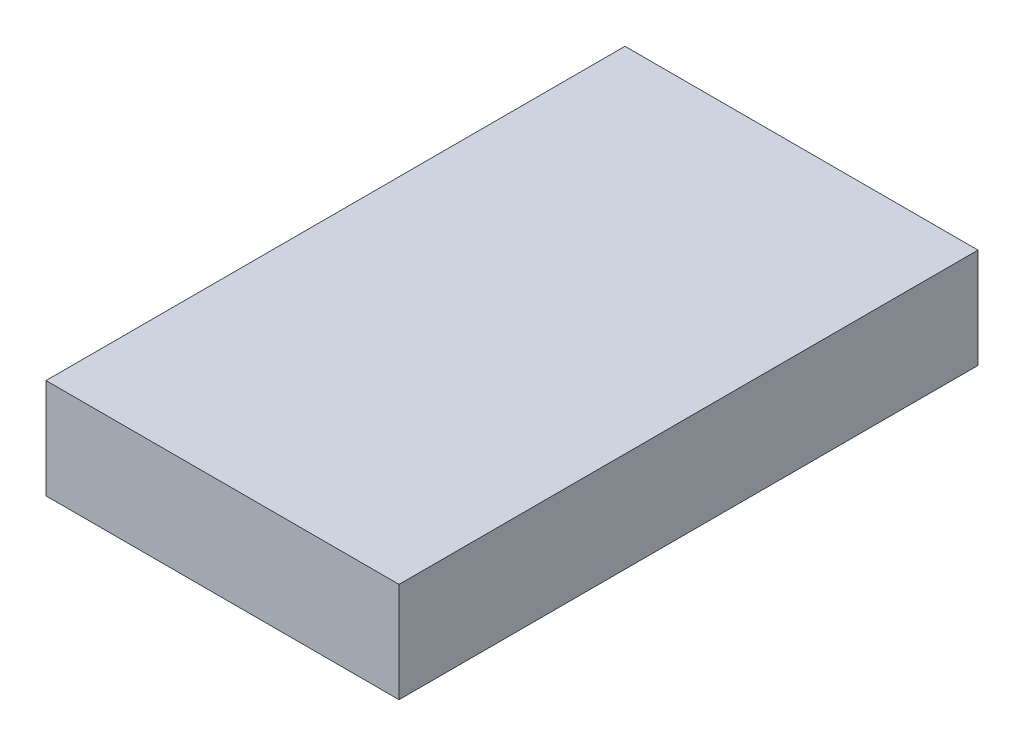
ISO-10303-21;
HEADER;
FILE_DESCRIPTION(('STEP AP214'),'2;1');
FILE_NAME('part.step','',(''),(''),'','','');
FILE_SCHEMA(('AUTOMOTIVE_DESIGN { 1 0 10303 214 1 1 1 1 }'));
ENDSEC;
DATA;
#1=APPLICATION_CONTEXT('core data for automotive mechanical design processes');
#2=APPLICATION_PROTOCOL_DEFINITION('international standard','automotive_design',2000,#1);
#3=PRODUCT_CONTEXT('',#1,'mechanical');
#4=PRODUCT('Part','Part','',(#3));
#5=PRODUCT_RELATED_PRODUCT_CATEGORY('part','',(#4));
#6=PRODUCT_DEFINITION_FORMATION('','',#4);
#7=PRODUCT_DEFINITION_CONTEXT('part definition',#1,'design');
#8=PRODUCT_DEFINITION('design','',#6,#7);
#9=PRODUCT_DEFINITION_SHAPE('','',#8);
#10=(LENGTH_UNIT() NAMED_UNIT(*) SI_UNIT(.MILLI.,.METRE.));
#11=(NAMED_UNIT(*) PLANE_ANGLE_UNIT() SI_UNIT($,.RADIAN.));
#12=(NAMED_UNIT(*) SI_UNIT($,.STERADIAN.) SOLID_ANGLE_UNIT());
#13=UNCERTAINTY_MEASURE_WITH_UNIT(LENGTH_MEASURE(1.E-05),#10,'distance_accuracy_value','');
#14=(GEOMETRIC_REPRESENTATION_CONTEXT(3) GLOBAL_UNCERTAINTY_ASSIGNED_CONTEXT((#13)) GLOBAL_UNIT_ASSIGNED_CONTEXT((#10,
#11,#12)) REPRESENTATION_CONTEXT('',''));
#15=CARTESIAN_POINT('',(0.,0.,0.));
#16=DIRECTION('',(0.,0.,1.));
#17=DIRECTION('',(1.,0.,0.));
#18=AXIS2_PLACEMENT_3D('',#15,#16,#17);
#19=CARTESIAN_POINT('',(0.,14.15,0.));
#20=DIRECTION('',(1.,0.,0.));
#21=DIRECTION('',(0.,0.,-1.));
#22=AXIS2_PLACEMENT_3D('',#19,#20,#21);
#23=PLANE('',#22);
#24=DIRECTION('',(0.,0.,1.));
#25=VECTOR('',#24,1.);
#26=CARTESIAN_POINT('',(0.,0.,0.));
#27=LINE('',#26,#25);
#28=CARTESIAN_POINT('',(0.,0.,0.));
#29=VERTEX_POINT('',#28);
#30=CARTESIAN_POINT('',(0.,0.,81.9999999999999));
#31=VERTEX_POINT('',#30);
#32=EDGE_CURVE('E96',#29,#31,#27,.T.);
#33=ORIENTED_EDGE('',*,*,#32,.T.);
#34=DIRECTION('',(0.,-1.,0.));
#35=VECTOR('',#34,1.);
#36=CARTESIAN_POINT('',(0.,14.15,81.9999999999999));
#37=LINE('',#36,#35);
#38=CARTESIAN_POINT('',(0.,14.15,81.9999999999999));
#39=VERTEX_POINT('',#38);
#40=EDGE_CURVE('E11',#39,#31,#37,.T.);
#41=ORIENTED_EDGE('',*,*,#40,.F.);
#42=DIRECTION('',(0.,0.,1.));
#43=VECTOR('',#42,1.);
#44=CARTESIAN_POINT('',(0.,14.15,0.));
#45=LINE('',#44,#43);
#46=CARTESIAN_POINT('',(0.,14.15,0.));
#47=VERTEX_POINT('',#46);
#48=EDGE_CURVE('E84',#47,#39,#45,.T.);
#49=ORIENTED_EDGE('',*,*,#48,.F.);
#50=DIRECTION('',(0.,-1.,0.));
#51=VECTOR('',#50,1.);
#52=CARTESIAN_POINT('',(0.,14.15,0.));
#53=LINE('',#52,#51);
#54=EDGE_CURVE('E92',#47,#29,#53,.T.);
#55=ORIENTED_EDGE('',*,*,#54,.T.);
#56=EDGE_LOOP('',(#33,#41,#49,#55));
#57=FACE_BOUND('',#56,.T.);
#58=ADVANCED_FACE('F33',(#57),#23,.F.);
#59=CARTESIAN_POINT('',(0.,14.15,81.9999999999999));
#60=DIRECTION('',(0.,0.,-1.));
#61=DIRECTION('',(-1.,0.,0.));
#62=AXIS2_PLACEMENT_3D('',#59,#60,#61);
#63=PLANE('',#62);
#64=DIRECTION('',(1.,0.,0.));
#65=VECTOR('',#64,1.);
#66=CARTESIAN_POINT('',(0.,0.,81.9999999999999));
#67=LINE('',#66,#65);
#68=CARTESIAN_POINT('',(50.,0.,81.9999999999999));
#69=VERTEX_POINT('',#68);
#70=EDGE_CURVE('E88',#31,#69,#67,.T.);
#71=ORIENTED_EDGE('',*,*,#70,.T.);
#72=DIRECTION('',(0.,-1.,0.));
#73=VECTOR('',#72,1.);
#74=CARTESIAN_POINT('',(50.,14.15,81.9999999999999));
#75=LINE('',#74,#73);
#76=CARTESIAN_POINT('',(50.,14.15,81.9999999999999));
#77=VERTEX_POINT('',#76);
#78=EDGE_CURVE('E41',#77,#69,#75,.T.);
#79=ORIENTED_EDGE('',*,*,#78,.F.);
#80=DIRECTION('',(1.,0.,0.));
#81=VECTOR('',#80,1.);
#82=CARTESIAN_POINT('',(0.,14.15,81.9999999999999));
#83=LINE('',#82,#81);
#84=EDGE_CURVE('E79',#39,#77,#83,.T.);
#85=ORIENTED_EDGE('',*,*,#84,.F.);
#86=ORIENTED_EDGE('',*,*,#40,.T.);
#87=EDGE_LOOP('',(#71,#79,#85,#86));
#88=FACE_BOUND('',#87,.T.);
#89=ADVANCED_FACE('F87',(#88),#63,.F.);
#90=CARTESIAN_POINT('',(50.,14.15,0.));
#91=DIRECTION('',(-1.,0.,0.));
#92=DIRECTION('',(0.,0.,1.));
#93=AXIS2_PLACEMENT_3D('',#90,#91,#92);
#94=PLANE('',#93);
#95=DIRECTION('',(0.,0.,-1.));
#96=VECTOR('',#95,1.);
#97=CARTESIAN_POINT('',(50.,0.,0.));
#98=LINE('',#97,#96);
#99=CARTESIAN_POINT('',(50.,0.,0.));
#100=VERTEX_POINT('',#99);
#101=EDGE_CURVE('E66',#69,#100,#98,.T.);
#102=ORIENTED_EDGE('',*,*,#101,.T.);
#103=DIRECTION('',(0.,-1.,0.));
#104=VECTOR('',#103,1.);
#105=CARTESIAN_POINT('',(50.,14.15,0.));
#106=LINE('',#105,#104);
#107=CARTESIAN_POINT('',(50.,14.15,0.));
#108=VERTEX_POINT('',#107);
#109=EDGE_CURVE('E89',#108,#100,#106,.T.);
#110=ORIENTED_EDGE('',*,*,#109,.F.);
#111=DIRECTION('',(0.,0.,-1.));
#112=VECTOR('',#111,1.);
#113=CARTESIAN_POINT('',(50.,14.15,0.));
#114=LINE('',#113,#112);
#115=EDGE_CURVE('E82',#77,#108,#114,.T.);
#116=ORIENTED_EDGE('',*,*,#115,.F.);
#117=ORIENTED_EDGE('',*,*,#78,.T.);
#118=EDGE_LOOP('',(#102,#110,#116,#117));
#119=FACE_BOUND('',#118,.T.);
#120=ADVANCED_FACE('F90',(#119),#94,.F.);
#121=CARTESIAN_POINT('',(0.,14.15,0.));
#122=DIRECTION('',(0.,0.,1.));
#123=DIRECTION('',(1.,0.,0.));
#124=AXIS2_PLACEMENT_3D('',#121,#122,#123);
#125=PLANE('',#124);
#126=DIRECTION('',(-1.,0.,0.));
#127=VECTOR('',#126,1.);
#128=CARTESIAN_POINT('',(0.,0.,0.));
#129=LINE('',#128,#127);
#130=EDGE_CURVE('E72',#100,#29,#129,.T.);
#131=ORIENTED_EDGE('',*,*,#130,.T.);
#132=ORIENTED_EDGE('',*,*,#54,.F.);
#133=DIRECTION('',(-1.,0.,0.));
#134=VECTOR('',#133,1.);
#135=CARTESIAN_POINT('',(0.,14.15,0.));
#136=LINE('',#135,#134);
#137=EDGE_CURVE('E49',#108,#47,#136,.T.);
#138=ORIENTED_EDGE('',*,*,#137,.F.);
#139=ORIENTED_EDGE('',*,*,#109,.T.);
#140=EDGE_LOOP('',(#131,#132,#138,#139));
#141=FACE_BOUND('',#140,.T.);
#142=ADVANCED_FACE('F103',(#141),#125,.F.);
#143=CARTESIAN_POINT('',(0.,14.15,0.));
#144=DIRECTION('',(0.,1.,0.));
#145=DIRECTION('',(0.,0.,1.));
#146=AXIS2_PLACEMENT_3D('',#143,#144,#145);
#147=PLANE('',#146);
#148=ORIENTED_EDGE('',*,*,#48,.T.);
#149=ORIENTED_EDGE('',*,*,#84,.T.);
#150=ORIENTED_EDGE('',*,*,#115,.T.);
#151=ORIENTED_EDGE('',*,*,#137,.T.);
#152=EDGE_LOOP('',(#148,#149,#150,#151));
#153=FACE_BOUND('',#152,.T.);
#154=ADVANCED_FACE('F80',(#153),#147,.T.);
#155=CARTESIAN_POINT('',(0.,0.,0.));
#156=DIRECTION('',(0.,1.,0.));
#157=DIRECTION('',(0.,0.,1.));
#158=AXIS2_PLACEMENT_3D('',#155,#156,#157);
#159=PLANE('',#158);
#160=ORIENTED_EDGE('',*,*,#32,.F.);
#161=ORIENTED_EDGE('',*,*,#130,.F.);
#162=ORIENTED_EDGE('',*,*,#101,.F.);
#163=ORIENTED_EDGE('',*,*,#70,.F.);
#164=EDGE_LOOP('',(#160,#161,#162,#163));
#165=FACE_BOUND('',#164,.T.);
#166=ADVANCED_FACE('F106',(#165),#159,.F.);
#167=CLOSED_SHELL('',(#58,#89,#120,#142,#154,#166));
#168=MANIFOLD_SOLID_BREP('B2',#167);
#169=ADVANCED_BREP_SHAPE_REPRESENTATION('',(#18,#168),#14);
#170=SHAPE_DEFINITION_REPRESENTATION(#9,#169);
ENDSEC;
END-ISO-10303-21;
